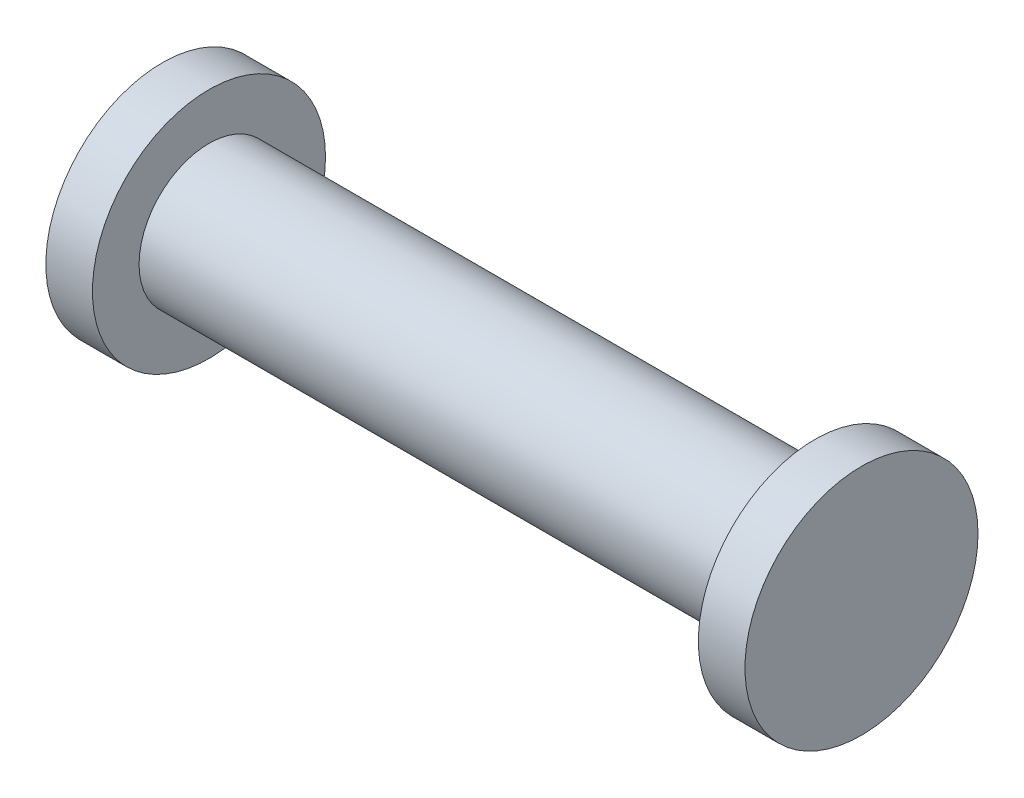
ISO-10303-21;
HEADER;
FILE_DESCRIPTION(('STEP AP214'),'2;1');
FILE_NAME('part.step','',(''),(''),'','','');
FILE_SCHEMA(('AUTOMOTIVE_DESIGN { 1 0 10303 214 1 1 1 1 }'));
ENDSEC;
DATA;
#1=APPLICATION_CONTEXT('core data for automotive mechanical design processes');
#2=APPLICATION_PROTOCOL_DEFINITION('international standard','automotive_design',2000,#1);
#3=PRODUCT_CONTEXT('',#1,'mechanical');
#4=PRODUCT('Part','Part','',(#3));
#5=PRODUCT_RELATED_PRODUCT_CATEGORY('part','',(#4));
#6=PRODUCT_DEFINITION_FORMATION('','',#4);
#7=PRODUCT_DEFINITION_CONTEXT('part definition',#1,'design');
#8=PRODUCT_DEFINITION('design','',#6,#7);
#9=PRODUCT_DEFINITION_SHAPE('','',#8);
#10=(LENGTH_UNIT() NAMED_UNIT(*) SI_UNIT(.MILLI.,.METRE.));
#11=(NAMED_UNIT(*) PLANE_ANGLE_UNIT() SI_UNIT($,.RADIAN.));
#12=(NAMED_UNIT(*) SI_UNIT($,.STERADIAN.) SOLID_ANGLE_UNIT());
#13=UNCERTAINTY_MEASURE_WITH_UNIT(LENGTH_MEASURE(1.E-05),#10,'distance_accuracy_value','');
#14=(GEOMETRIC_REPRESENTATION_CONTEXT(3) GLOBAL_UNCERTAINTY_ASSIGNED_CONTEXT((#13)) GLOBAL_UNIT_ASSIGNED_CONTEXT((#10,
#11,#12)) REPRESENTATION_CONTEXT('',''));
#15=CARTESIAN_POINT('',(0.,0.,0.));
#16=DIRECTION('',(0.,0.,1.));
#17=DIRECTION('',(1.,0.,0.));
#18=AXIS2_PLACEMENT_3D('',#15,#16,#17);
#19=CARTESIAN_POINT('',(32.5,0.,0.));
#20=DIRECTION('',(-1.,0.,0.));
#21=DIRECTION('',(0.,0.,1.));
#22=AXIS2_PLACEMENT_3D('',#19,#20,#21);
#23=CYLINDRICAL_SURFACE('',#22,7.5);
#24=CARTESIAN_POINT('',(32.5,0.,0.));
#25=DIRECTION('',(1.,0.,0.));
#26=DIRECTION('',(0.,0.,-1.));
#27=AXIS2_PLACEMENT_3D('',#24,#25,#26);
#28=CIRCLE('',#27,7.5);
#29=CARTESIAN_POINT('',(32.5,0.,-7.5));
#30=VERTEX_POINT('',#29);
#31=EDGE_CURVE('E10',#30,#30,#28,.T.);
#32=ORIENTED_EDGE('',*,*,#31,.F.);
#33=EDGE_LOOP('',(#32));
#34=FACE_BOUND('',#33,.T.);
#35=CARTESIAN_POINT('',(-32.5,0.,0.));
#36=DIRECTION('',(-1.,0.,0.));
#37=DIRECTION('',(0.,0.,1.));
#38=AXIS2_PLACEMENT_3D('',#35,#36,#37);
#39=CIRCLE('',#38,7.5);
#40=CARTESIAN_POINT('',(-32.5,0.,7.5));
#41=VERTEX_POINT('',#40);
#42=EDGE_CURVE('E48',#41,#41,#39,.T.);
#43=ORIENTED_EDGE('',*,*,#42,.F.);
#44=EDGE_LOOP('',(#43));
#45=FACE_BOUND('',#44,.T.);
#46=ADVANCED_FACE('F33',(#34,#45),#23,.T.);
#47=CARTESIAN_POINT('',(37.5,0.,0.));
#48=DIRECTION('',(-1.,0.,0.));
#49=DIRECTION('',(0.,0.,1.));
#50=AXIS2_PLACEMENT_3D('',#47,#48,#49);
#51=CYLINDRICAL_SURFACE('',#50,12.5);
#52=CARTESIAN_POINT('',(37.5,0.,0.));
#53=DIRECTION('',(1.,0.,0.));
#54=DIRECTION('',(0.,0.,-1.));
#55=AXIS2_PLACEMENT_3D('',#52,#53,#54);
#56=CIRCLE('',#55,12.5);
#57=CARTESIAN_POINT('',(37.5,0.,-12.5));
#58=VERTEX_POINT('',#57);
#59=EDGE_CURVE('E39',#58,#58,#56,.T.);
#60=ORIENTED_EDGE('',*,*,#59,.F.);
#61=EDGE_LOOP('',(#60));
#62=FACE_BOUND('',#61,.T.);
#63=CARTESIAN_POINT('',(32.5,0.,0.));
#64=DIRECTION('',(1.,0.,0.));
#65=DIRECTION('',(0.,0.,-1.));
#66=AXIS2_PLACEMENT_3D('',#63,#64,#65);
#67=CIRCLE('',#66,12.5);
#68=CARTESIAN_POINT('',(32.5,0.,-12.5));
#69=VERTEX_POINT('',#68);
#70=EDGE_CURVE('E43',#69,#69,#67,.T.);
#71=ORIENTED_EDGE('',*,*,#70,.T.);
#72=EDGE_LOOP('',(#71));
#73=FACE_BOUND('',#72,.T.);
#74=ADVANCED_FACE('F75',(#62,#73),#51,.T.);
#75=CARTESIAN_POINT('',(37.5,0.,0.));
#76=DIRECTION('',(1.,0.,0.));
#77=DIRECTION('',(0.,0.,-1.));
#78=AXIS2_PLACEMENT_3D('',#75,#76,#77);
#79=PLANE('',#78);
#80=ORIENTED_EDGE('',*,*,#59,.T.);
#81=EDGE_LOOP('',(#80));
#82=FACE_BOUND('',#81,.T.);
#83=ADVANCED_FACE('F80',(#82),#79,.T.);
#84=CARTESIAN_POINT('',(32.5,0.,0.));
#85=DIRECTION('',(1.,0.,0.));
#86=DIRECTION('',(0.,0.,-1.));
#87=AXIS2_PLACEMENT_3D('',#84,#85,#86);
#88=PLANE('',#87);
#89=ORIENTED_EDGE('',*,*,#31,.T.);
#90=EDGE_LOOP('',(#89));
#91=FACE_BOUND('',#90,.T.);
#92=ORIENTED_EDGE('',*,*,#70,.F.);
#93=EDGE_LOOP('',(#92));
#94=FACE_BOUND('',#93,.T.);
#95=ADVANCED_FACE('F72',(#91,#94),#88,.F.);
#96=CARTESIAN_POINT('',(-37.5,0.,0.));
#97=DIRECTION('',(1.,0.,0.));
#98=DIRECTION('',(0.,0.,-1.));
#99=AXIS2_PLACEMENT_3D('',#96,#97,#98);
#100=CYLINDRICAL_SURFACE('',#99,12.5);
#101=CARTESIAN_POINT('',(-37.5,0.,0.));
#102=DIRECTION('',(1.,0.,0.));
#103=DIRECTION('',(0.,0.,-1.));
#104=AXIS2_PLACEMENT_3D('',#101,#102,#103);
#105=CIRCLE('',#104,12.5);
#106=CARTESIAN_POINT('',(-37.5,0.,-12.5));
#107=VERTEX_POINT('',#106);
#108=EDGE_CURVE('E52',#107,#107,#105,.T.);
#109=ORIENTED_EDGE('',*,*,#108,.T.);
#110=EDGE_LOOP('',(#109));
#111=FACE_BOUND('',#110,.T.);
#112=CARTESIAN_POINT('',(-32.5,0.,0.));
#113=DIRECTION('',(1.,0.,0.));
#114=DIRECTION('',(0.,0.,-1.));
#115=AXIS2_PLACEMENT_3D('',#112,#113,#114);
#116=CIRCLE('',#115,12.5);
#117=CARTESIAN_POINT('',(-32.5,0.,-12.5));
#118=VERTEX_POINT('',#117);
#119=EDGE_CURVE('E53',#118,#118,#116,.T.);
#120=ORIENTED_EDGE('',*,*,#119,.F.);
#121=EDGE_LOOP('',(#120));
#122=FACE_BOUND('',#121,.T.);
#123=ADVANCED_FACE('F59',(#111,#122),#100,.T.);
#124=CARTESIAN_POINT('',(-37.5,0.,0.));
#125=DIRECTION('',(-1.,0.,0.));
#126=DIRECTION('',(0.,0.,-1.));
#127=AXIS2_PLACEMENT_3D('',#124,#125,#126);
#128=PLANE('',#127);
#129=ORIENTED_EDGE('',*,*,#108,.F.);
#130=EDGE_LOOP('',(#129));
#131=FACE_BOUND('',#130,.T.);
#132=ADVANCED_FACE('F62',(#131),#128,.T.);
#133=CARTESIAN_POINT('',(-32.5,0.,0.));
#134=DIRECTION('',(-1.,0.,0.));
#135=DIRECTION('',(0.,0.,-1.));
#136=AXIS2_PLACEMENT_3D('',#133,#134,#135);
#137=PLANE('',#136);
#138=ORIENTED_EDGE('',*,*,#42,.T.);
#139=EDGE_LOOP('',(#138));
#140=FACE_BOUND('',#139,.T.);
#141=ORIENTED_EDGE('',*,*,#119,.T.);
#142=EDGE_LOOP('',(#141));
#143=FACE_BOUND('',#142,.T.);
#144=ADVANCED_FACE('F64',(#140,#143),#137,.F.);
#145=CLOSED_SHELL('',(#46,#74,#83,#95,#123,#132,#144));
#146=MANIFOLD_SOLID_BREP('B2',#145);
#147=ADVANCED_BREP_SHAPE_REPRESENTATION('',(#18,#146),#14);
#148=SHAPE_DEFINITION_REPRESENTATION(#9,#147);
ENDSEC;
END-ISO-10303-21;
